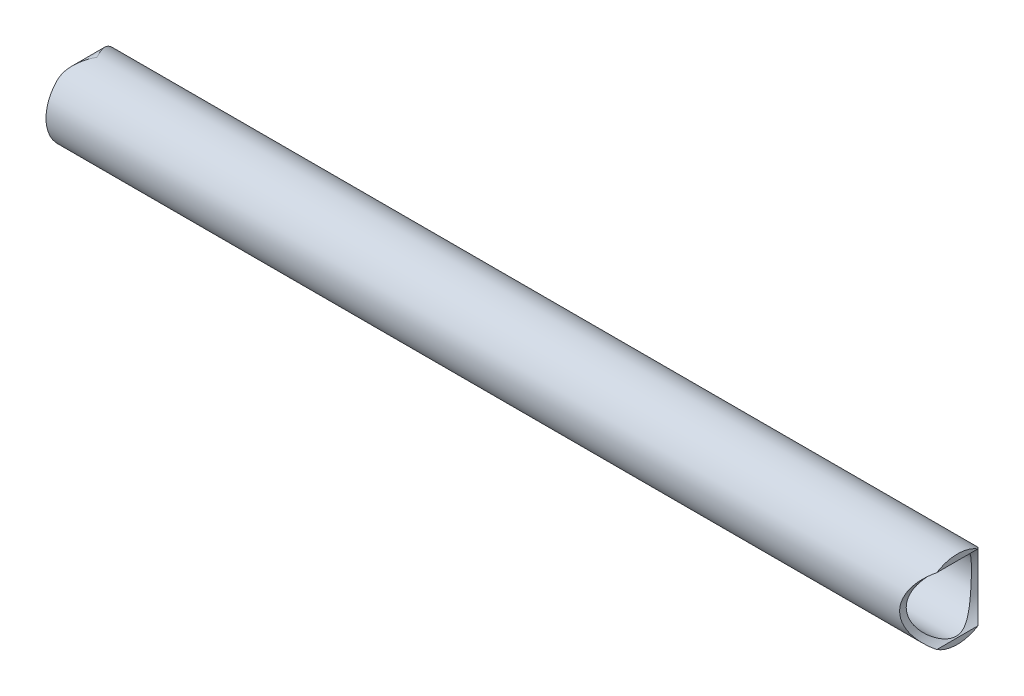
ISO-10303-21;
HEADER;
FILE_DESCRIPTION(('STEP AP214'),'2;1');
FILE_NAME('part.step','',(''),(''),'','','');
FILE_SCHEMA(('AUTOMOTIVE_DESIGN { 1 0 10303 214 1 1 1 1 }'));
ENDSEC;
DATA;
#1=APPLICATION_CONTEXT('core data for automotive mechanical design processes');
#2=APPLICATION_PROTOCOL_DEFINITION('international standard','automotive_design',2000,#1);
#3=PRODUCT_CONTEXT('',#1,'mechanical');
#4=PRODUCT('Part','Part','',(#3));
#5=PRODUCT_RELATED_PRODUCT_CATEGORY('part','',(#4));
#6=PRODUCT_DEFINITION_FORMATION('','',#4);
#7=PRODUCT_DEFINITION_CONTEXT('part definition',#1,'design');
#8=PRODUCT_DEFINITION('design','',#6,#7);
#9=PRODUCT_DEFINITION_SHAPE('','',#8);
#10=(LENGTH_UNIT() NAMED_UNIT(*) SI_UNIT(.MILLI.,.METRE.));
#11=(NAMED_UNIT(*) PLANE_ANGLE_UNIT() SI_UNIT($,.RADIAN.));
#12=(NAMED_UNIT(*) SI_UNIT($,.STERADIAN.) SOLID_ANGLE_UNIT());
#13=UNCERTAINTY_MEASURE_WITH_UNIT(LENGTH_MEASURE(1.E-05),#10,'distance_accuracy_value','');
#14=(GEOMETRIC_REPRESENTATION_CONTEXT(3) GLOBAL_UNCERTAINTY_ASSIGNED_CONTEXT((#13)) GLOBAL_UNIT_ASSIGNED_CONTEXT((#10,
#11,#12)) REPRESENTATION_CONTEXT('',''));
#15=CARTESIAN_POINT('',(0.,0.,0.));
#16=DIRECTION('',(0.,0.,1.));
#17=DIRECTION('',(1.,0.,0.));
#18=AXIS2_PLACEMENT_3D('',#15,#16,#17);
#19=CARTESIAN_POINT('',(469.10625,0.,0.));
#20=DIRECTION('',(1.,0.,0.));
#21=DIRECTION('',(0.,0.,-1.));
#22=AXIS2_PLACEMENT_3D('',#19,#20,#21);
#23=PLANE('',#22);
#24=DIRECTION('',(0.,0.,1.));
#25=VECTOR('',#24,1.);
#26=CARTESIAN_POINT('',(469.10625,17.9154421589309,-21.082));
#27=LINE('',#26,#25);
#28=CARTESIAN_POINT('',(469.10625,17.9154421589309,-11.1125));
#29=VERTEX_POINT('',#28);
#30=CARTESIAN_POINT('',(469.10625,17.915442158931,11.1125));
#31=VERTEX_POINT('',#30);
#32=EDGE_CURVE('E92',#29,#31,#27,.T.);
#33=ORIENTED_EDGE('',*,*,#32,.F.);
#34=CARTESIAN_POINT('',(469.10625,0.,0.));
#35=DIRECTION('',(1.,0.,0.));
#36=DIRECTION('',(0.,0.,-1.));
#37=AXIS2_PLACEMENT_3D('',#34,#35,#36);
#38=CIRCLE('',#37,21.082);
#39=EDGE_CURVE('E52',#29,#31,#38,.T.);
#40=ORIENTED_EDGE('',*,*,#39,.T.);
#41=EDGE_LOOP('',(#33,#40));
#42=FACE_BOUND('',#41,.T.);
#43=ADVANCED_FACE('F37',(#42),#23,.T.);
#44=DIRECTION('',(0.,0.,1.));
#45=VECTOR('',#44,1.);
#46=CARTESIAN_POINT('',(469.10625,-17.9154421589309,-21.082));
#47=LINE('',#46,#45);
#48=CARTESIAN_POINT('',(469.10625,-17.915442158931,11.1125));
#49=VERTEX_POINT('',#48);
#50=CARTESIAN_POINT('',(469.10625,-17.9154421589309,-11.1125));
#51=VERTEX_POINT('',#50);
#52=EDGE_CURVE('E89',#49,#51,#47,.F.);
#53=ORIENTED_EDGE('',*,*,#52,.F.);
#54=EDGE_CURVE('E97',#49,#51,#38,.T.);
#55=ORIENTED_EDGE('',*,*,#54,.T.);
#56=EDGE_LOOP('',(#53,#55));
#57=FACE_BOUND('',#56,.T.);
#58=ADVANCED_FACE('F96',(#57),#23,.T.);
#59=CARTESIAN_POINT('',(0.,0.,0.));
#60=DIRECTION('',(1.,0.,0.));
#61=DIRECTION('',(0.,0.,-1.));
#62=AXIS2_PLACEMENT_3D('',#59,#60,#61);
#63=PLANE('',#62);
#64=CARTESIAN_POINT('',(0.,0.,0.));
#65=DIRECTION('',(1.,0.,0.));
#66=DIRECTION('',(0.,0.,-1.));
#67=AXIS2_PLACEMENT_3D('',#64,#65,#66);
#68=CIRCLE('',#67,21.082);
#69=CARTESIAN_POINT('',(0.,14.732,15.0804144505382));
#70=VERTEX_POINT('',#69);
#71=CARTESIAN_POINT('',(0.,14.732,-15.0804144505382));
#72=VERTEX_POINT('',#71);
#73=EDGE_CURVE('E100',#70,#72,#68,.T.);
#74=ORIENTED_EDGE('',*,*,#73,.F.);
#75=DIRECTION('',(0.,0.,1.));
#76=VECTOR('',#75,1.);
#77=CARTESIAN_POINT('',(0.,14.732,-21.082));
#78=LINE('',#77,#76);
#79=CARTESIAN_POINT('',(0.,14.732,9.49362164824362));
#80=VERTEX_POINT('',#79);
#81=EDGE_CURVE('E130',#80,#70,#78,.T.);
#82=ORIENTED_EDGE('',*,*,#81,.F.);
#83=CARTESIAN_POINT('',(0.,0.,0.));
#84=DIRECTION('',(1.,0.,0.));
#85=DIRECTION('',(0.,0.,-1.));
#86=AXIS2_PLACEMENT_3D('',#83,#84,#85);
#87=CIRCLE('',#86,17.526);
#88=CARTESIAN_POINT('',(0.,14.732,-9.49362164824362));
#89=VERTEX_POINT('',#88);
#90=EDGE_CURVE('E103',#80,#89,#87,.T.);
#91=ORIENTED_EDGE('',*,*,#90,.T.);
#92=EDGE_CURVE('E66',#72,#89,#78,.T.);
#93=ORIENTED_EDGE('',*,*,#92,.F.);
#94=EDGE_LOOP('',(#74,#82,#91,#93));
#95=FACE_BOUND('',#94,.T.);
#96=ADVANCED_FACE('F143',(#95),#63,.F.);
#97=CARTESIAN_POINT('',(469.10625,0.,0.));
#98=DIRECTION('',(-1.,0.,0.));
#99=DIRECTION('',(0.,0.,1.));
#100=AXIS2_PLACEMENT_3D('',#97,#98,#99);
#101=CYLINDRICAL_SURFACE('',#100,21.082);
#102=ORIENTED_EDGE('',*,*,#73,.T.);
#103=CARTESIAN_POINT('',(0.,14.732,-15.0804144505382));
#104=CARTESIAN_POINT('',(4.99777097256306E-06,14.8585166363932,-14.9568250218965));
#105=CARTESIAN_POINT('',(0.0037804024379681,14.9834433145249,-14.8316684363902));
#106=CARTESIAN_POINT('',(0.018344612519162,15.2298802862784,-14.578499414352));
#107=CARTESIAN_POINT('',(0.0291313987626797,15.3513915529794,-14.4504878102679));
#108=CARTESIAN_POINT('',(0.0711641868780703,15.7100653220193,-14.0630095037458));
#109=CARTESIAN_POINT('',(0.112087001365868,15.9418874425845,-13.7995912481011));
#110=CARTESIAN_POINT('',(0.215488507432889,16.3879660671565,-13.2666880799684));
#111=CARTESIAN_POINT('',(0.277765297706076,16.6023646270495,-12.997281336883));
#112=CARTESIAN_POINT('',(0.420807437337394,17.0156387002352,-12.4513482602452));
#113=CARTESIAN_POINT('',(0.501584818248204,17.2145039983668,-12.1748173979638));
#114=CARTESIAN_POINT('',(0.722336490267377,17.6901137279932,-11.4788940830607));
#115=CARTESIAN_POINT('',(0.871915178025879,17.9572278098856,-11.0559422302578));
#116=CARTESIAN_POINT('',(1.19848542775072,18.4567086453977,-10.2003069203716));
#117=CARTESIAN_POINT('',(1.37548494857253,18.6890652721093,-9.76762066916));
#118=CARTESIAN_POINT('',(1.75209895067343,19.1211226362083,-8.89229878891464));
#119=CARTESIAN_POINT('',(1.9518397925665,19.3206241773796,-8.4496197349844));
#120=CARTESIAN_POINT('',(2.36824696498252,19.6862817768882,-7.55863388229215));
#121=CARTESIAN_POINT('',(2.58491234738668,19.8524397012882,-7.11032739995988));
#122=CARTESIAN_POINT('',(3.07854021979459,20.1841782782303,-6.11397748165988));
#123=CARTESIAN_POINT('',(3.35855407719812,20.3421826858222,-5.56492077807607));
#124=CARTESIAN_POINT('',(3.93195657278609,20.6121360645314,-4.46237555433802));
#125=CARTESIAN_POINT('',(4.2253492325938,20.7240710846151,-3.90888574337448));
#126=CARTESIAN_POINT('',(4.81966564824809,20.9026212412311,-2.80091191808466));
#127=CARTESIAN_POINT('',(5.12056407013035,20.9693718110366,-2.24643591433334));
#128=CARTESIAN_POINT('',(5.7263441140806,21.0587059818151,-1.13639917411688));
#129=CARTESIAN_POINT('',(6.0312234277849,21.0813141259917,-0.580839212441869));
#130=CARTESIAN_POINT('',(6.34068566822062,21.0819948744209,-0.0169715207830517));
#131=CARTESIAN_POINT('',(6.34534284661023,21.081999997751,-0.00848573804402203));
#132=CARTESIAN_POINT('',(6.35,21.082,0.));
#133=B_SPLINE_CURVE_WITH_KNOTS('',3,(#103,#104,#105,#106,#107,#108,#109,#110,#111,#112,#113,
#114,#115,#116,#117,#118,#119,#120,#121,#122,#123,#124,#125,#126,#127,#128,#129,#130,#131,#132),
.UNSPECIFIED.,.F.,.F.,(4,2,2,2,2,2,2,2,2,2,2,2,2,2,4),(0.,0.530465682198346,1.06077866603508,
2.11923257632368,3.16794284977036,4.21733708093636,5.78132496799527,7.34576765361523,
8.91937150261676,10.4928872609037,12.3996794344843,14.3070486112538,16.2086751300639,
18.1092440424708,18.1382833302831),.UNSPECIFIED.);
#134=CARTESIAN_POINT('',(6.35,21.082,0.));
#135=VERTEX_POINT('',#134);
#136=EDGE_CURVE('E129',#72,#135,#133,.T.);
#137=ORIENTED_EDGE('',*,*,#136,.T.);
#138=CARTESIAN_POINT('',(0.,14.732,15.0804144505382));
#139=CARTESIAN_POINT('',(4.99777097265902E-06,14.8585166363932,14.9568250218965));
#140=CARTESIAN_POINT('',(0.00378040243796859,14.983443314525,14.8316684363902));
#141=CARTESIAN_POINT('',(0.0183446125191639,15.2298802862785,14.5784994143519));
#142=CARTESIAN_POINT('',(0.0291313987626825,15.3513915529794,14.4504878102678));
#143=CARTESIAN_POINT('',(0.071164186878077,15.7100653220194,14.0630095037458));
#144=CARTESIAN_POINT('',(0.112087001365878,15.9418874425845,13.799591248101));
#145=CARTESIAN_POINT('',(0.215488507432905,16.3879660671565,13.2666880799683));
#146=CARTESIAN_POINT('',(0.277765297706091,16.6023646270495,12.9972813368829));
#147=CARTESIAN_POINT('',(0.420807437337405,17.0156387002352,12.4513482602451));
#148=CARTESIAN_POINT('',(0.501584818248212,17.2145039983668,12.1748173979638));
#149=CARTESIAN_POINT('',(0.722336490267378,17.6901137279932,11.4788940830607));
#150=CARTESIAN_POINT('',(0.871915178025876,17.9572278098856,11.0559422302578));
#151=CARTESIAN_POINT('',(1.19848542775071,18.4567086453976,10.2003069203717));
#152=CARTESIAN_POINT('',(1.37548494857251,18.6890652721093,9.76762066916005));
#153=CARTESIAN_POINT('',(1.75209895067341,19.1211226362082,8.89229878891469));
#154=CARTESIAN_POINT('',(1.95183979256649,19.3206241773795,8.44961973498444));
#155=CARTESIAN_POINT('',(2.36824696498251,19.6862817768881,7.55863388229216));
#156=CARTESIAN_POINT('',(2.58491234738667,19.8524397012882,7.11032739995988));
#157=CARTESIAN_POINT('',(3.0785402197946,20.1841782782303,6.11397748165988));
#158=CARTESIAN_POINT('',(3.35855407719814,20.3421826858222,5.56492077807609));
#159=CARTESIAN_POINT('',(3.93195657278606,20.6121360645314,4.462375554338));
#160=CARTESIAN_POINT('',(4.22534923259369,20.7240710846151,3.90888574337441));
#161=CARTESIAN_POINT('',(4.81966564824822,20.9026212412311,2.80091191808473));
#162=CARTESIAN_POINT('',(5.12056407013078,20.9693718110366,2.24643591433359));
#163=CARTESIAN_POINT('',(5.72634411408013,21.0587059818151,1.13639917411665));
#164=CARTESIAN_POINT('',(6.03122342778322,21.0813141259917,0.580839212440988));
#165=CARTESIAN_POINT('',(6.34068566822056,21.0819948744209,0.0169715207830728));
#166=CARTESIAN_POINT('',(6.3453428466102,21.081999997751,0.00848573804405541));
#167=CARTESIAN_POINT('',(6.35,21.082,0.));
#168=B_SPLINE_CURVE_WITH_KNOTS('',3,(#138,#139,#140,#141,#142,#143,#144,#145,#146,#147,#148,
#149,#150,#151,#152,#153,#154,#155,#156,#157,#158,#159,#160,#161,#162,#163,#164,#165,#166,#167),
.UNSPECIFIED.,.F.,.F.,(4,2,2,2,2,2,2,2,2,2,2,2,2,2,4),(0.,0.530465682198373,1.06077866603513,
2.11923257632378,3.16794284977042,4.21733708093637,5.78132496799524,7.34576765361516,
8.91937150261673,10.4928872609037,12.3996794344843,14.3070486112539,16.2086751300639,
18.1092440424708,18.1382833302831),.UNSPECIFIED.);
#169=EDGE_CURVE('E122',#135,#70,#168,.F.);
#170=ORIENTED_EDGE('',*,*,#169,.T.);
#171=EDGE_LOOP('',(#102,#137,#170));
#172=FACE_BOUND('',#171,.T.);
#173=ORIENTED_EDGE('',*,*,#39,.F.);
#174=CARTESIAN_POINT('',(480.21875,0.,0.));
#175=DIRECTION('',(-0.707106781186548,0.,0.707106781186547));
#176=DIRECTION('',(-0.707106781186548,0.,-0.707106781186547));
#177=AXIS2_PLACEMENT_3D('',#174,#175,#176);
#178=ELLIPSE('',#177,29.8144503219496,21.082);
#179=EDGE_CURVE('E99',#29,#51,#178,.T.);
#180=ORIENTED_EDGE('',*,*,#179,.T.);
#181=ORIENTED_EDGE('',*,*,#54,.F.);
#182=CARTESIAN_POINT('',(480.21875,0.,0.));
#183=DIRECTION('',(-0.707106781186548,0.,-0.707106781186547));
#184=DIRECTION('',(-0.707106781186548,0.,0.707106781186547));
#185=AXIS2_PLACEMENT_3D('',#182,#183,#184);
#186=ELLIPSE('',#185,29.8144503219496,21.082);
#187=EDGE_CURVE('E59',#49,#31,#186,.T.);
#188=ORIENTED_EDGE('',*,*,#187,.T.);
#189=EDGE_LOOP('',(#173,#180,#181,#188));
#190=FACE_BOUND('',#189,.T.);
#191=ADVANCED_FACE('F39',(#172,#190),#101,.T.);
#192=CARTESIAN_POINT('',(469.10625,0.,0.));
#193=DIRECTION('',(-1.,0.,0.));
#194=DIRECTION('',(0.,0.,1.));
#195=AXIS2_PLACEMENT_3D('',#192,#193,#194);
#196=CYLINDRICAL_SURFACE('',#195,17.526);
#197=CARTESIAN_POINT('',(459.13675,0.,17.526));
#198=CARTESIAN_POINT('',(459.136753100232,0.416555730228906,17.525996813955));
#199=CARTESIAN_POINT('',(459.149123313981,0.833163012071545,17.5111221446535));
#200=CARTESIAN_POINT('',(459.198320724751,1.66285085098589,17.4518957288154));
#201=CARTESIAN_POINT('',(459.235152005793,2.0759308074684,17.4075390599622));
#202=CARTESIAN_POINT('',(459.332452439066,2.89546158233793,17.2901260170745));
#203=CARTESIAN_POINT('',(459.392938843433,3.30190733638105,17.2170486963236));
#204=CARTESIAN_POINT('',(459.536212942405,4.10484124386305,17.0434647188049));
#205=CARTESIAN_POINT('',(459.619000210819,4.50132958743919,16.9429585862272));
#206=CARTESIAN_POINT('',(459.804608337995,5.27944797465432,16.7167963170662));
#207=CARTESIAN_POINT('',(459.907303655403,5.66115402240748,16.5912976561353));
#208=CARTESIAN_POINT('',(460.13114125938,6.41026860382347,16.3165047587702));
#209=CARTESIAN_POINT('',(460.252283245215,6.77767737045173,16.1672109102661));
#210=CARTESIAN_POINT('',(460.510997114563,7.49674702968466,15.8465909890381));
#211=CARTESIAN_POINT('',(460.648570010029,7.84840695050787,15.6752635592522));
#212=CARTESIAN_POINT('',(460.938082247339,8.53495429518089,15.3122852034019));
#213=CARTESIAN_POINT('',(461.090024633481,8.86983814178559,15.1206299696701));
#214=CARTESIAN_POINT('',(461.464140089599,9.64160099861961,14.6449374869007));
#215=CARTESIAN_POINT('',(461.691652769384,10.0709113512938,14.3527749107548));
#216=CARTESIAN_POINT('',(462.164488465582,10.8958978241818,13.7370028939555));
#217=CARTESIAN_POINT('',(462.409817485787,11.2915625079794,13.4133828401386));
#218=CARTESIAN_POINT('',(462.913798875036,12.049775776248,12.7366579401323));
#219=CARTESIAN_POINT('',(463.17248335067,12.4122381349312,12.3834806406871));
#220=CARTESIAN_POINT('',(463.697391944567,13.102805813699,11.6503545982694));
#221=CARTESIAN_POINT('',(463.963615114459,13.4309154311957,11.2704092138659));
#222=CARTESIAN_POINT('',(464.503016862729,14.0584742968281,10.4776077506457));
#223=CARTESIAN_POINT('',(464.776233749344,14.3572918160694,10.0642778803075));
#224=CARTESIAN_POINT('',(465.318313078632,14.9191165849368,9.21095532717234));
#225=CARTESIAN_POINT('',(465.587174038226,15.1821118547605,8.77095379548327));
#226=CARTESIAN_POINT('',(466.111691041438,15.6706637077535,7.86481925902692));
#227=CARTESIAN_POINT('',(466.367377460908,15.8963093356672,7.39875205622169));
#228=CARTESIAN_POINT('',(466.855669817722,16.3089147666568,6.43838077354218));
#229=CARTESIAN_POINT('',(467.088295378546,16.4959076106971,5.94410127510899));
#230=CARTESIAN_POINT('',(467.419892415188,16.7529770224336,5.15602712210236));
#231=CARTESIAN_POINT('',(467.531806838252,16.837735543251,4.872411200417));
#232=CARTESIAN_POINT('',(467.741705453925,16.9938564773723,4.29634473218566));
#233=CARTESIAN_POINT('',(467.83968784338,17.0652171570416,4.00389304799845));
#234=CARTESIAN_POINT('',(468.018453347219,17.1934754104678,3.41127303424146));
#235=CARTESIAN_POINT('',(468.099269928926,17.2504011700851,3.11112102298287));
#236=CARTESIAN_POINT('',(468.240783138788,17.3489622258268,2.503748224318));
#237=CARTESIAN_POINT('',(468.301490351692,17.3906055672393,2.19653124698383));
#238=CARTESIAN_POINT('',(468.400642338332,17.4581424184477,1.57275012439623));
#239=CARTESIAN_POINT('',(468.438798088988,17.4838316609619,1.25611705495765));
#240=CARTESIAN_POINT('',(468.489564384314,17.517930419636,0.619877416859227));
#241=CARTESIAN_POINT('',(468.502177230519,17.526341492641,0.300271118708478));
#242=CARTESIAN_POINT('',(468.501123738161,17.5256372212721,-0.338900631657943));
#243=CARTESIAN_POINT('',(468.487455708289,17.5165207489109,-0.658466079921118));
#244=CARTESIAN_POINT('',(468.434638550502,17.4810304342677,-1.29450990358539));
#245=CARTESIAN_POINT('',(468.395486264212,17.454654452937,-1.61098789140883));
#246=CARTESIAN_POINT('',(468.289324257895,17.3822895125155,-2.26597180787558));
#247=CARTESIAN_POINT('',(468.220160695607,17.3347748801548,-2.6039563959663));
#248=CARTESIAN_POINT('',(468.05798050578,17.2213863424108,-3.27094152568147));
#249=CARTESIAN_POINT('',(467.964960013026,17.1555094618906,-3.59994060193884));
#250=CARTESIAN_POINT('',(467.758998964524,17.0065131076897,-4.24855727345));
#251=CARTESIAN_POINT('',(467.64600613574,16.9233482836622,-4.56814761827544));
#252=CARTESIAN_POINT('',(467.404253660727,16.7410384013215,-5.19667563423267));
#253=CARTESIAN_POINT('',(467.275487866865,16.6418871073676,-5.50560909125264));
#254=CARTESIAN_POINT('',(466.927147015409,16.3663636741079,-6.28987340285503));
#255=CARTESIAN_POINT('',(466.698405644521,16.1786783054546,-6.75718011774374));
#256=CARTESIAN_POINT('',(466.221976191773,15.7683263145676,-7.66612047395263));
#257=CARTESIAN_POINT('',(465.974277188512,15.5456394491178,-8.10773905469757));
#258=CARTESIAN_POINT('',(465.468372952079,15.0664754392744,-8.96683638051191));
#259=CARTESIAN_POINT('',(465.21015403316,14.8099532398125,-9.38428185098054));
#260=CARTESIAN_POINT('',(464.690466965766,14.2641231324516,-10.1948087082538));
#261=CARTESIAN_POINT('',(464.428999471574,13.9748217341554,-10.5878949086503));
#262=CARTESIAN_POINT('',(463.895324879337,13.348195218157,-11.368790869149));
#263=CARTESIAN_POINT('',(463.623240901127,13.0091843032674,-11.7553355433847));
#264=CARTESIAN_POINT('',(463.087541373633,12.2951909614096,-12.5002060187878));
#265=CARTESIAN_POINT('',(462.823927094039,11.9202031744408,-12.8585276006225));
#266=CARTESIAN_POINT('',(462.311174827839,11.1350258886843,-13.5441070863272));
#267=CARTESIAN_POINT('',(462.062010084927,10.7249051788906,-13.8714231651622));
#268=CARTESIAN_POINT('',(461.7029705029,10.0834868401277,-14.3371461507588));
#269=CARTESIAN_POINT('',(461.585752726259,9.8653306424743,-14.4881649831134));
#270=CARTESIAN_POINT('',(461.356837871324,9.42027707168284,-14.7814103315513));
#271=CARTESIAN_POINT('',(461.245142151037,9.19337757252926,-14.9236346869964));
#272=CARTESIAN_POINT('',(460.973493112914,8.61498224084044,-15.2678084182525));
#273=CARTESIAN_POINT('',(460.817459068209,8.25811349099297,-15.4639027842676));
#274=CARTESIAN_POINT('',(460.521964191443,7.52616004996061,-15.8330525436508));
#275=CARTESIAN_POINT('',(460.382499423159,7.15107971509298,-16.0061134100713));
#276=CARTESIAN_POINT('',(460.122537175912,6.38410638575886,-16.3271734823368));
#277=CARTESIAN_POINT('',(460.00203301395,5.99221937735624,-16.4751815198914));
#278=CARTESIAN_POINT('',(459.782250109816,5.19343454244432,-16.7441479493523));
#279=CARTESIAN_POINT('',(459.682971726726,4.78653646212599,-16.8651058836479));
#280=CARTESIAN_POINT('',(459.507089403541,3.95712937963007,-17.0788335101842));
#281=CARTESIAN_POINT('',(459.430663185674,3.53452536865489,-17.1713824047497));
#282=CARTESIAN_POINT('',(459.30330895774,2.67986601870688,-17.325342710614));
#283=CARTESIAN_POINT('',(459.252380994275,2.24781066246181,-17.3867540650041));
#284=CARTESIAN_POINT('',(459.177324216148,1.37821649825806,-17.4771905064637));
#285=CARTESIAN_POINT('',(459.153182158585,0.940680508218323,-17.5062315973617));
#286=CARTESIAN_POINT('',(459.132290012414,0.0640313485043037,-17.5313661812511));
#287=CARTESIAN_POINT('',(459.135537074792,-0.37508165237985,-17.5274631010918));
#288=CARTESIAN_POINT('',(459.167335633984,-1.19930498558239,-17.4891990815668));
#289=CARTESIAN_POINT('',(459.192874675364,-1.58470875998572,-17.4584640327402));
#290=CARTESIAN_POINT('',(459.264684232639,-2.35069997583225,-17.3719144045829));
#291=CARTESIAN_POINT('',(459.310952802018,-2.73128786604044,-17.3161021800126));
#292=CARTESIAN_POINT('',(459.42332254399,-3.48513791526224,-17.1802563891461));
#293=CARTESIAN_POINT('',(459.489424907109,-3.85839963308743,-17.1002213688688));
#294=CARTESIAN_POINT('',(459.64024630486,-4.59536738648546,-16.9170761014037));
#295=CARTESIAN_POINT('',(459.724966273857,-4.95907294143571,-16.813964696073));
#296=CARTESIAN_POINT('',(459.913145504431,-5.68108005964255,-16.5840874699882));
#297=CARTESIAN_POINT('',(460.016895992016,-6.03918783157445,-16.4569529541794));
#298=CARTESIAN_POINT('',(460.240467917882,-6.74203119401674,-16.1817226350541));
#299=CARTESIAN_POINT('',(460.360289050715,-7.08676703852215,-16.033627230131));
#300=CARTESIAN_POINT('',(460.614268706947,-7.7617711253795,-15.7179651464271));
#301=CARTESIAN_POINT('',(460.748429245294,-8.09203732526567,-15.5503957309038));
#302=CARTESIAN_POINT('',(461.029307650088,-8.73727082208682,-15.1972398091077));
#303=CARTESIAN_POINT('',(461.176028031205,-9.05223503545283,-15.0116496938153));
#304=CARTESIAN_POINT('',(461.548812920572,-9.80464712063615,-14.5364034891831));
#305=CARTESIAN_POINT('',(461.780846995919,-10.2333578451482,-14.2375288779349));
#306=CARTESIAN_POINT('',(462.262358234905,-11.0565036944503,-13.6081978996813));
#307=CARTESIAN_POINT('',(462.511842112484,-11.4509254939542,-13.2777293585403));
#308=CARTESIAN_POINT('',(463.023748955069,-12.2062013475731,-12.5869774042746));
#309=CARTESIAN_POINT('',(463.286207884647,-12.5669530526875,-12.2266089972621));
#310=CARTESIAN_POINT('',(463.817996141297,-13.253470559835,-11.4788424530418));
#311=CARTESIAN_POINT('',(464.08732447637,-13.5792413783913,-11.091448204724));
#312=CARTESIAN_POINT('',(464.631962798302,-14.2012900820747,-10.2834169092844));
#313=CARTESIAN_POINT('',(464.907294003942,-14.4969406813881,-9.8623113113111));
#314=CARTESIAN_POINT('',(465.452322074852,-15.0517275612925,-8.99289776114401));
#315=CARTESIAN_POINT('',(465.722016777624,-15.3108500388738,-8.54457961710635));
#316=CARTESIAN_POINT('',(466.246222682617,-15.7906628138659,-7.62139093429989));
#317=CARTESIAN_POINT('',(466.500775922646,-16.0114631279653,-7.14660175430663));
#318=CARTESIAN_POINT('',(466.984149383237,-16.4132437140876,-6.16809279152978));
#319=CARTESIAN_POINT('',(467.212994501134,-16.5942626782093,-5.6644017261431));
#320=CARTESIAN_POINT('',(467.533166365567,-16.8388425611419,-4.86810478458098));
#321=CARTESIAN_POINT('',(467.63901918611,-16.9179225696371,-4.58604260557915));
#322=CARTESIAN_POINT('',(467.836250596365,-17.062806654192,-4.01353560636163));
#323=CARTESIAN_POINT('',(467.92763123726,-17.1286126119829,-3.72309198098292));
#324=CARTESIAN_POINT('',(468.092782938295,-17.2459247048064,-3.13503376582409));
#325=CARTESIAN_POINT('',(468.166590343537,-17.2974603903694,-2.83743540296246));
#326=CARTESIAN_POINT('',(468.29389080646,-17.3854671554674,-2.23575303013736));
#327=CARTESIAN_POINT('',(468.347389138256,-17.4219421463683,-1.93167072569972));
#328=CARTESIAN_POINT('',(468.432050986908,-17.4793343349965,-1.31542257105261));
#329=CARTESIAN_POINT('',(468.462959056324,-17.5000736934338,-1.00320440672016));
#330=CARTESIAN_POINT('',(468.499785417953,-17.524756770186,-0.376634351053846));
#331=CARTESIAN_POINT('',(468.505705534394,-17.5287017145648,-0.0622826171578791));
#332=CARTESIAN_POINT('',(468.492219236601,-17.519682115217,0.565765427557123));
#333=CARTESIAN_POINT('',(468.472801625762,-17.5067100959756,0.87946138722474));
#334=CARTESIAN_POINT('',(468.409708218613,-17.4642111799082,1.50326166249684));
#335=CARTESIAN_POINT('',(468.366029014212,-17.4346819572413,1.8133654672525));
#336=CARTESIAN_POINT('',(468.24947913328,-17.3549094765865,2.46783373112703));
#337=CARTESIAN_POINT('',(468.173539424602,-17.302463431889,2.81137909094881));
#338=CARTESIAN_POINT('',(467.99769360765,-17.1787080018257,3.48874159064592));
#339=CARTESIAN_POINT('',(467.897782550923,-17.1073947213456,3.82255670590954));
#340=CARTESIAN_POINT('',(467.678186596836,-16.947078987979,4.48018532937914));
#341=CARTESIAN_POINT('',(467.55845074705,-16.8580308311813,4.80397044519033));
#342=CARTESIAN_POINT('',(467.303531095877,-16.6635408359202,5.44039078400235));
#343=CARTESIAN_POINT('',(467.168341323107,-16.5580926547885,5.75302163536546));
#344=CARTESIAN_POINT('',(466.803678142386,-16.2655608949425,6.54686642927639));
#345=CARTESIAN_POINT('',(466.565311783285,-16.0668060807317,7.0197186237903));
#346=CARTESIAN_POINT('',(466.070778251224,-15.6331071713109,7.93883090279246));
#347=CARTESIAN_POINT('',(465.814601013657,-15.3981425218364,8.38507568297595));
#348=CARTESIAN_POINT('',(465.292991177891,-14.8931005076266,9.25247800104897));
#349=CARTESIAN_POINT('',(465.027546784682,-14.6229771058186,9.67360157184695));
#350=CARTESIAN_POINT('',(464.49479644847,-14.0485414814654,10.4903942108924));
#351=CARTESIAN_POINT('',(464.227490886297,-13.7442360709218,10.8860683262347));
#352=CARTESIAN_POINT('',(463.685008627962,-13.0872302237909,11.6686564771624));
#353=CARTESIAN_POINT('',(463.410011314537,-12.7329783860628,12.0543962817461));
#354=CARTESIAN_POINT('',(462.870324829164,-11.9872775461265,12.7961902436962));
#355=CARTESIAN_POINT('',(462.60563734665,-11.5958224834142,13.1522395466039));
#356=CARTESIAN_POINT('',(462.092856716602,-10.776623787392,13.8313916713883));
#357=CARTESIAN_POINT('',(461.844731277596,-10.3489546907981,14.1545592898452));
#358=CARTESIAN_POINT('',(461.489058671317,-9.6805538418048,14.6123392874479));
#359=CARTESIAN_POINT('',(461.373266967441,-9.45330032462178,14.7604208100894));
#360=CARTESIAN_POINT('',(461.147843154438,-8.98986303225831,15.0471693205303));
#361=CARTESIAN_POINT('',(461.03821252428,-8.7536771354263,15.1858340494738));
#362=CARTESIAN_POINT('',(460.777882456114,-8.16388969440334,15.5135810654738));
#363=CARTESIAN_POINT('',(460.631019615212,-7.80547285234025,15.6971201066552));
#364=CARTESIAN_POINT('',(460.354258282389,-7.07152507053722,16.0411475968501));
#365=CARTESIAN_POINT('',(460.224355748624,-6.69599823719479,16.2016415386992));
#366=CARTESIAN_POINT('',(459.983865788701,-5.92969186792639,16.4975121757086));
#367=CARTESIAN_POINT('',(459.873255954141,-5.53893068115682,16.6329180221441));
#368=CARTESIAN_POINT('',(459.673317296928,-4.74382214338575,16.8768969338328));
#369=CARTESIAN_POINT('',(459.583984673672,-4.33947723349805,16.9854747913174));
#370=CARTESIAN_POINT('',(459.445844180231,-3.61139042732534,17.1529959877094));
#371=CARTESIAN_POINT('',(459.392441530083,-3.2898093654496,17.2176086822695));
#372=CARTESIAN_POINT('',(459.300313709527,-2.64139463379433,17.3289327236608));
#373=CARTESIAN_POINT('',(459.261591366206,-2.31455996491102,17.3756406224611));
#374=CARTESIAN_POINT('',(459.199400717763,-1.657300955975,17.4505998410856));
#375=CARTESIAN_POINT('',(459.175933854947,-1.32687627951213,17.4788494157967));
#376=CARTESIAN_POINT('',(459.144609151471,-0.66431170552806,17.5165484873698));
#377=CARTESIAN_POINT('',(459.136747527795,-0.332172243283639,17.5260025406341));
#378=CARTESIAN_POINT('',(459.13675,0.,17.526));
#379=B_SPLINE_CURVE_WITH_KNOTS('',3,(#197,#198,#199,#200,#201,#202,#203,#204,#205,#206,#207,
#208,#209,#210,#211,#212,#213,#214,#215,#216,#217,#218,#219,#220,#221,#222,#223,#224,#225,#226,
#227,#228,#229,#230,#231,#232,#233,#234,#235,#236,#237,#238,#239,#240,#241,#242,#243,#244,#245,
#246,#247,#248,#249,#250,#251,#252,#253,#254,#255,#256,#257,#258,#259,#260,#261,#262,#263,#264,
#265,#266,#267,#268,#269,#270,#271,#272,#273,#274,#275,#276,#277,#278,#279,#280,#281,#282,#283,
#284,#285,#286,#287,#288,#289,#290,#291,#292,#293,#294,#295,#296,#297,#298,#299,#300,#301,#302,
#303,#304,#305,#306,#307,#308,#309,#310,#311,#312,#313,#314,#315,#316,#317,#318,#319,#320,#321,
#322,#323,#324,#325,#326,#327,#328,#329,#330,#331,#332,#333,#334,#335,#336,#337,#338,#339,#340,
#341,#342,#343,#344,#345,#346,#347,#348,#349,#350,#351,#352,#353,#354,#355,#356,#357,#358,#359,
#360,#361,#362,#363,#364,#365,#366,#367,#368,#369,#370,#371,#372,#373,#374,#375,#376,#377,#378),
.UNSPECIFIED.,.T.,.F.,(4,2,2,2,2,2,2,2,2,2,2,2,2,2,2,2,2,2,2,2,2,2,2,2,2,2,2,2,2,2,2,2,2,2,2,2,
2,2,2,2,2,2,2,2,2,2,2,2,2,2,2,2,2,2,2,2,2,2,2,2,2,2,2,2,2,2,2,2,2,2,2,2,2,2,2,2,2,2,2,2,2,2,2,2,
2,2,2,2,2,2,4),(0.,1.24931215514068,2.49883294793602,3.74926674484587,4.99967664647633,
6.24244384055415,7.48519077601582,8.72801428973392,9.97110169852848,11.6694991969452,
13.3684717049052,15.0717382323203,16.7747914316099,18.508900041403,20.2435871614538,
21.974077138334,23.7030816933734,24.6518793950268,25.6007997833557,26.5478527733324,
27.4944064783684,28.4528421356183,29.4111914294722,30.3696024000782,31.3281321733839,
32.3712679495731,33.4145728378166,34.4606499010713,35.5071359859366,37.1638893836605,
38.8216045193316,40.4815497807695,42.1411659704712,43.8844508919193,45.6279959405214,
47.3682019789461,48.238133531576,49.1082779678088,50.4151915777868,51.7217940919451,
53.0279350344375,54.3340980714494,55.6501696985348,56.9662437309291,58.2816668085292,
59.5969530576398,60.7579780281908,61.9188940006416,63.0798796712698,64.240923621771,
65.4214962902465,66.6020465231705,67.7827628635306,68.9637161565106,70.6766447530631,
72.3902360758568,74.1088773225334,75.8272717729951,77.5762157648221,79.3258188748362,
81.0703129492533,82.8131027115062,83.7469352207905,84.6806352566832,85.6123870984828,
86.5438968054863,87.4857834704328,88.4276013724583,89.3698355997799,90.3122022187916,
91.3777285366849,92.4434750028669,93.5120043575646,94.5809479956882,96.2751844313667,
97.9703861554526,99.6678303471317,101.364936859805,103.137598327809,104.910549063673,
106.679935458133,107.564410898222,108.449097758104,109.733689326203,111.01797419982,
112.300757301213,113.58331109564,114.579500372221,115.575881394522,116.57235660447,
117.568590219854),.UNSPECIFIED.);
#380=CARTESIAN_POINT('',(459.13675,0.,17.526));
#381=VERTEX_POINT('',#380);
#382=EDGE_CURVE('E42',#381,#381,#379,.T.);
#383=ORIENTED_EDGE('',*,*,#382,.F.);
#384=EDGE_LOOP('',(#383));
#385=FACE_BOUND('',#384,.T.);
#386=CARTESIAN_POINT('',(0.,14.732,-9.49362164824361));
#387=CARTESIAN_POINT('',(1.18215827092096E-05,14.8512065552147,-9.30864758850528));
#388=CARTESIAN_POINT('',(0.00335629290756961,14.966903733683,-9.12145207419103));
#389=CARTESIAN_POINT('',(0.015618373053566,15.191067778283,-8.74302268186063));
#390=CARTESIAN_POINT('',(0.024534469369689,15.2995365978256,-8.55178991342886));
#391=CARTESIAN_POINT('',(0.0468365894807759,15.5089823218411,-8.16580160022169));
#392=CARTESIAN_POINT('',(0.0602176995159619,15.6099673136364,-7.97105014964136));
#393=CARTESIAN_POINT('',(0.0904463086584942,15.8044598611726,-7.57811282719616));
#394=CARTESIAN_POINT('',(0.107294062917175,15.8979668658161,-7.3799267035169));
#395=CARTESIAN_POINT('',(0.161710749515973,16.1677428894095,-6.77922295697602));
#396=CARTESIAN_POINT('',(0.203066270989696,16.3325710230985,-6.37184299640371));
#397=CARTESIAN_POINT('',(0.28865530712156,16.6311343918077,-5.5460775193833));
#398=CARTESIAN_POINT('',(0.332889819449679,16.7648587740876,-5.12768821805969));
#399=CARTESIAN_POINT('',(0.420233364203613,17.0075279308424,-4.25683335736751));
#400=CARTESIAN_POINT('',(0.463124929061231,17.1145638855675,-3.80380674958994));
#401=CARTESIAN_POINT('',(0.519476718498732,17.2479052083383,-3.11843895481312));
#402=CARTESIAN_POINT('',(0.536930761583319,17.2878189125596,-2.88899376313145));
#403=CARTESIAN_POINT('',(0.568518618471742,17.3584967782642,-2.42847866805183));
#404=CARTESIAN_POINT('',(0.582652788803805,17.3892619223255,-2.19740894186361));
#405=CARTESIAN_POINT('',(0.60700831203503,17.4414967310561,-1.73463327297525));
#406=CARTESIAN_POINT('',(0.617239840917754,17.4629905896764,-1.50293059363321));
#407=CARTESIAN_POINT('',(0.633438941414769,17.4967389939057,-1.03872466306625));
#408=CARTESIAN_POINT('',(0.639406934130212,17.5089944519799,-0.806221493184098));
#409=CARTESIAN_POINT('',(0.646841906691908,17.5242321079992,-0.340835958369956));
#410=CARTESIAN_POINT('',(0.648308834845186,17.5272141994432,-0.107953589113738));
#411=CARTESIAN_POINT('',(0.646683444701061,17.5238958672413,0.357727673351307));
#412=CARTESIAN_POINT('',(0.64359113409545,17.5175954592557,0.590526566700303));
#413=CARTESIAN_POINT('',(0.633015011982841,17.4958254842557,1.05357258230511));
#414=CARTESIAN_POINT('',(0.625569519654457,17.4804359133699,1.28382432502859));
#415=CARTESIAN_POINT('',(0.606616305295421,17.4405997328694,1.74338121783046));
#416=CARTESIAN_POINT('',(0.595108185917324,17.416152237328,1.97268627309738));
#417=CARTESIAN_POINT('',(0.555116369049375,17.3293085585805,2.65858155894497));
#418=CARTESIAN_POINT('',(0.521163416818214,17.2534079290171,3.11322070575031));
#419=CARTESIAN_POINT('',(0.443683996229778,17.0661243267718,4.01506176899039));
#420=CARTESIAN_POINT('',(0.400139881988926,16.9546757811965,4.4622483212256));
#421=CARTESIAN_POINT('',(0.31015365623528,16.6970370744889,5.34616265629826));
#422=CARTESIAN_POINT('',(0.263712022198695,16.5508526263209,5.78289214600579));
#423=CARTESIAN_POINT('',(0.190296116221632,16.2789916862365,6.49992819615105));
#424=CARTESIAN_POINT('',(0.162003200675152,16.1627907207943,6.78372963515089));
#425=CARTESIAN_POINT('',(0.109990072823221,15.9155254057193,7.34511810644267));
#426=CARTESIAN_POINT('',(0.0862682339282398,15.7844663697057,7.62270731812361));
#427=CARTESIAN_POINT('',(0.0460592939801918,15.5080873202831,8.17029076843601));
#428=CARTESIAN_POINT('',(0.0295522145321793,15.3628080690132,8.44030401764001));
#429=CARTESIAN_POINT('',(0.00654051357353983,15.0579847067746,8.9728539714487));
#430=CARTESIAN_POINT('',(4.36685221627461E-05,14.898429607302,9.23538470802819));
#431=CARTESIAN_POINT('',(0.,14.732,9.49362164824361));
#432=B_SPLINE_CURVE_WITH_KNOTS('',3,(#386,#387,#388,#389,#390,#391,#392,#393,#394,#395,#396,
#397,#398,#399,#400,#401,#402,#403,#404,#405,#406,#407,#408,#409,#410,#411,#412,#413,#414,#415,
#416,#417,#418,#419,#420,#421,#422,#423,#424,#425,#426,#427,#428,#429,#430,#431),.UNSPECIFIED.,
.F.,.F.,(4,2,2,2,2,2,2,2,2,2,2,2,2,2,2,2,2,2,2,2,2,2,4),(0.,0.660061225427474,1.31994334467436,
1.97910164384406,2.6383084756313,3.96109639181251,5.2843451659066,6.68505552254074,
7.38551890925716,8.08590703728532,8.78445623939876,9.48293643762741,10.1814246575994,
10.8799116991686,11.5723409064333,12.2648378558842,13.6496257450175,15.0369829791431,
16.4241121943468,17.3476269451524,18.2708124595747,19.1914251291658,20.1127526175606),.UNSPECIFIED.);
#433=EDGE_CURVE('E11',#89,#80,#432,.T.);
#434=ORIENTED_EDGE('',*,*,#433,.F.);
#435=ORIENTED_EDGE('',*,*,#90,.F.);
#436=EDGE_LOOP('',(#434,#435));
#437=FACE_BOUND('',#436,.T.);
#438=ADVANCED_FACE('F112',(#385,#437),#196,.F.);
#439=CARTESIAN_POINT('',(6.35,14.732,-21.082));
#440=DIRECTION('',(0.,0.,1.));
#441=DIRECTION('',(1.,0.,0.));
#442=AXIS2_PLACEMENT_3D('',#439,#440,#441);
#443=CYLINDRICAL_SURFACE('',#442,6.35);
#444=ORIENTED_EDGE('',*,*,#92,.T.);
#445=ORIENTED_EDGE('',*,*,#433,.T.);
#446=ORIENTED_EDGE('',*,*,#81,.T.);
#447=ORIENTED_EDGE('',*,*,#169,.F.);
#448=ORIENTED_EDGE('',*,*,#136,.F.);
#449=EDGE_LOOP('',(#444,#445,#446,#447,#448));
#450=FACE_BOUND('',#449,.T.);
#451=ADVANCED_FACE('F115',(#450),#443,.T.);
#452=CARTESIAN_POINT('',(480.21875,0.,-21.082));
#453=DIRECTION('',(0.,0.,1.));
#454=DIRECTION('',(1.,0.,0.));
#455=AXIS2_PLACEMENT_3D('',#452,#453,#454);
#456=CYLINDRICAL_SURFACE('',#455,21.082);
#457=ORIENTED_EDGE('',*,*,#382,.T.);
#458=EDGE_LOOP('',(#457));
#459=FACE_BOUND('',#458,.T.);
#460=ORIENTED_EDGE('',*,*,#32,.T.);
#461=ORIENTED_EDGE('',*,*,#187,.F.);
#462=ORIENTED_EDGE('',*,*,#52,.T.);
#463=ORIENTED_EDGE('',*,*,#179,.F.);
#464=EDGE_LOOP('',(#460,#461,#462,#463));
#465=FACE_BOUND('',#464,.T.);
#466=ADVANCED_FACE('F88',(#459,#465),#456,.F.);
#467=CLOSED_SHELL('',(#43,#58,#96,#191,#438,#451,#466));
#468=MANIFOLD_SOLID_BREP('B2',#467);
#469=ADVANCED_BREP_SHAPE_REPRESENTATION('',(#18,#468),#14);
#470=SHAPE_DEFINITION_REPRESENTATION(#9,#469);
ENDSEC;
END-ISO-10303-21;
